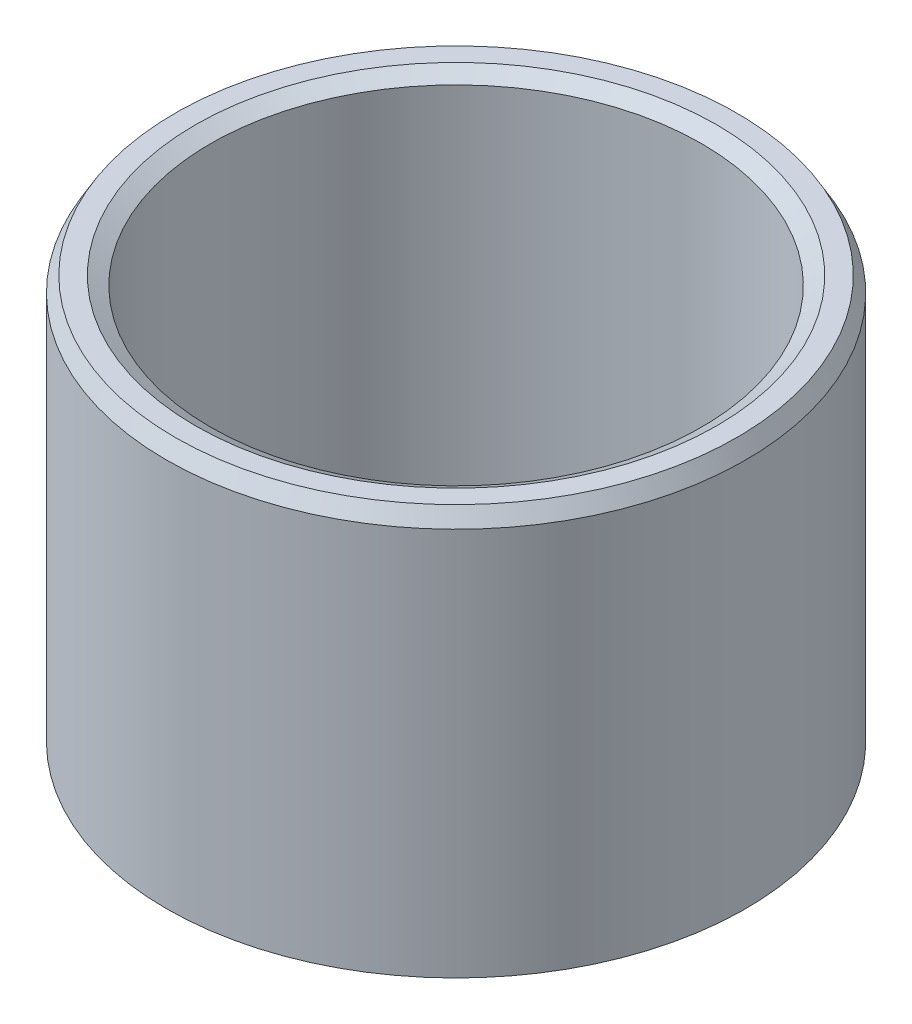
ISO-10303-21;
HEADER;
FILE_DESCRIPTION(('STEP AP214'),'2;1');
FILE_NAME('part.step','',(''),(''),'','','');
FILE_SCHEMA(('AUTOMOTIVE_DESIGN { 1 0 10303 214 1 1 1 1 }'));
ENDSEC;
DATA;
#1=APPLICATION_CONTEXT('core data for automotive mechanical design processes');
#2=APPLICATION_PROTOCOL_DEFINITION('international standard','automotive_design',2000,#1);
#3=PRODUCT_CONTEXT('',#1,'mechanical');
#4=PRODUCT('Part','Part','',(#3));
#5=PRODUCT_RELATED_PRODUCT_CATEGORY('part','',(#4));
#6=PRODUCT_DEFINITION_FORMATION('','',#4);
#7=PRODUCT_DEFINITION_CONTEXT('part definition',#1,'design');
#8=PRODUCT_DEFINITION('design','',#6,#7);
#9=PRODUCT_DEFINITION_SHAPE('','',#8);
#10=(LENGTH_UNIT() NAMED_UNIT(*) SI_UNIT(.MILLI.,.METRE.));
#11=(NAMED_UNIT(*) PLANE_ANGLE_UNIT() SI_UNIT($,.RADIAN.));
#12=(NAMED_UNIT(*) SI_UNIT($,.STERADIAN.) SOLID_ANGLE_UNIT());
#13=UNCERTAINTY_MEASURE_WITH_UNIT(LENGTH_MEASURE(1.E-05),#10,'distance_accuracy_value','');
#14=(GEOMETRIC_REPRESENTATION_CONTEXT(3) GLOBAL_UNCERTAINTY_ASSIGNED_CONTEXT((#13)) GLOBAL_UNIT_ASSIGNED_CONTEXT((#10,
#11,#12)) REPRESENTATION_CONTEXT('',''));
#15=CARTESIAN_POINT('',(0.,0.,0.));
#16=DIRECTION('',(0.,0.,1.));
#17=DIRECTION('',(1.,0.,0.));
#18=AXIS2_PLACEMENT_3D('',#15,#16,#17);
#19=CARTESIAN_POINT('',(0.,85.4439495294284,0.));
#20=DIRECTION('',(0.,-1.,0.));
#21=DIRECTION('',(0.,0.,-1.));
#22=AXIS2_PLACEMENT_3D('',#19,#20,#21);
#23=CYLINDRICAL_SURFACE('',#22,60.);
#24=CARTESIAN_POINT('',(0.,1.81136118549563,0.));
#25=DIRECTION('',(0.,1.,0.));
#26=DIRECTION('',(0.,0.,1.));
#27=AXIS2_PLACEMENT_3D('',#24,#25,#26);
#28=CIRCLE('',#27,60.);
#29=CARTESIAN_POINT('',(0.,1.81136118549563,60.));
#30=VERTEX_POINT('',#29);
#31=EDGE_CURVE('E10',#30,#30,#28,.T.);
#32=ORIENTED_EDGE('',*,*,#31,.T.);
#33=EDGE_LOOP('',(#32));
#34=FACE_BOUND('',#33,.T.);
#35=CARTESIAN_POINT('',(0.,82.3065799252917,0.));
#36=DIRECTION('',(0.,1.,0.));
#37=DIRECTION('',(0.,0.,1.));
#38=AXIS2_PLACEMENT_3D('',#35,#36,#37);
#39=CIRCLE('',#38,60.);
#40=CARTESIAN_POINT('',(0.,82.3065799252917,60.));
#41=VERTEX_POINT('',#40);
#42=EDGE_CURVE('E50',#41,#41,#39,.F.);
#43=ORIENTED_EDGE('',*,*,#42,.T.);
#44=EDGE_LOOP('',(#43));
#45=FACE_BOUND('',#44,.T.);
#46=ADVANCED_FACE('F39',(#34,#45),#23,.T.);
#47=CARTESIAN_POINT('',(0.,85.4439495294284,0.));
#48=DIRECTION('',(0.,1.,0.));
#49=DIRECTION('',(0.,0.,1.));
#50=AXIS2_PLACEMENT_3D('',#47,#48,#49);
#51=PLANE('',#50);
#52=CARTESIAN_POINT('',(0.,85.4439495294284,0.));
#53=DIRECTION('',(0.,1.,0.));
#54=DIRECTION('',(0.,0.,1.));
#55=AXIS2_PLACEMENT_3D('',#52,#53,#54);
#56=CIRCLE('',#55,54.0024252240746);
#57=CARTESIAN_POINT('',(0.,85.4439495294284,54.0024252240746));
#58=VERTEX_POINT('',#57);
#59=EDGE_CURVE('E58',#58,#58,#56,.F.);
#60=ORIENTED_EDGE('',*,*,#59,.T.);
#61=EDGE_LOOP('',(#60));
#62=FACE_BOUND('',#61,.T.);
#63=CARTESIAN_POINT('',(0.,85.4439495294284,0.));
#64=DIRECTION('',(0.,1.,0.));
#65=DIRECTION('',(0.,0.,1.));
#66=AXIS2_PLACEMENT_3D('',#63,#64,#65);
#67=CIRCLE('',#66,58.1886388145043);
#68=CARTESIAN_POINT('',(0.,85.4439495294284,58.1886388145043));
#69=VERTEX_POINT('',#68);
#70=EDGE_CURVE('E61',#69,#69,#67,.T.);
#71=ORIENTED_EDGE('',*,*,#70,.T.);
#72=EDGE_LOOP('',(#71));
#73=FACE_BOUND('',#72,.T.);
#74=ADVANCED_FACE('F88',(#62,#73),#51,.T.);
#75=CARTESIAN_POINT('',(0.,0.,0.));
#76=DIRECTION('',(0.,1.,0.));
#77=DIRECTION('',(0.,0.,1.));
#78=AXIS2_PLACEMENT_3D('',#75,#76,#77);
#79=PLANE('',#78);
#80=CARTESIAN_POINT('',(0.,0.,0.));
#81=DIRECTION('',(0.,1.,0.));
#82=DIRECTION('',(0.,0.,1.));
#83=AXIS2_PLACEMENT_3D('',#80,#81,#82);
#84=CIRCLE('',#83,52.6764168054336);
#85=CARTESIAN_POINT('',(0.,0.,52.6764168054336));
#86=VERTEX_POINT('',#85);
#87=EDGE_CURVE('E51',#86,#86,#84,.T.);
#88=ORIENTED_EDGE('',*,*,#87,.T.);
#89=EDGE_LOOP('',(#88));
#90=FACE_BOUND('',#89,.T.);
#91=CARTESIAN_POINT('',(0.,0.,0.));
#92=DIRECTION('',(0.,1.,0.));
#93=DIRECTION('',(0.,0.,1.));
#94=AXIS2_PLACEMENT_3D('',#91,#92,#93);
#95=CIRCLE('',#94,56.8626303958633);
#96=CARTESIAN_POINT('',(0.,0.,56.8626303958633));
#97=VERTEX_POINT('',#96);
#98=EDGE_CURVE('E54',#97,#97,#95,.F.);
#99=ORIENTED_EDGE('',*,*,#98,.T.);
#100=EDGE_LOOP('',(#99));
#101=FACE_BOUND('',#100,.T.);
#102=ADVANCED_FACE('F83',(#90,#101),#79,.F.);
#103=CARTESIAN_POINT('',(0.,85.4439495294284,0.));
#104=DIRECTION('',(0.,-1.,0.));
#105=DIRECTION('',(0.,0.,-1.));
#106=AXIS2_PLACEMENT_3D('',#103,#104,#105);
#107=CYLINDRICAL_SURFACE('',#106,50.865055619938);
#108=CARTESIAN_POINT('',(0.,83.6325883439328,0.));
#109=DIRECTION('',(0.,1.,0.));
#110=DIRECTION('',(0.,0.,1.));
#111=AXIS2_PLACEMENT_3D('',#108,#109,#110);
#112=CIRCLE('',#111,50.865055619938);
#113=CARTESIAN_POINT('',(0.,83.6325883439328,50.865055619938));
#114=VERTEX_POINT('',#113);
#115=EDGE_CURVE('E67',#114,#114,#112,.T.);
#116=ORIENTED_EDGE('',*,*,#115,.T.);
#117=EDGE_LOOP('',(#116));
#118=FACE_BOUND('',#117,.T.);
#119=CARTESIAN_POINT('',(0.,3.13736960413662,0.));
#120=DIRECTION('',(0.,1.,0.));
#121=DIRECTION('',(0.,0.,1.));
#122=AXIS2_PLACEMENT_3D('',#119,#120,#121);
#123=CIRCLE('',#122,50.865055619938);
#124=CARTESIAN_POINT('',(0.,3.13736960413662,50.865055619938));
#125=VERTEX_POINT('',#124);
#126=EDGE_CURVE('E69',#125,#125,#123,.F.);
#127=ORIENTED_EDGE('',*,*,#126,.T.);
#128=EDGE_LOOP('',(#127));
#129=FACE_BOUND('',#128,.T.);
#130=ADVANCED_FACE('F71',(#118,#129),#107,.F.);
#131=CARTESIAN_POINT('',(0.,83.6325883439328,0.));
#132=DIRECTION('',(0.,1.,0.));
#133=DIRECTION('',(0.,0.,1.));
#134=AXIS2_PLACEMENT_3D('',#131,#132,#133);
#135=CONICAL_SURFACE('',#134,50.865055619938,1.0471975511966);
#136=ORIENTED_EDGE('',*,*,#59,.F.);
#137=EDGE_LOOP('',(#136));
#138=FACE_BOUND('',#137,.T.);
#139=ORIENTED_EDGE('',*,*,#115,.F.);
#140=EDGE_LOOP('',(#139));
#141=FACE_BOUND('',#140,.T.);
#142=ADVANCED_FACE('F77',(#138,#141),#135,.F.);
#143=CARTESIAN_POINT('',(0.,0.,0.));
#144=DIRECTION('',(0.,-1.,0.));
#145=DIRECTION('',(0.,0.,-1.));
#146=AXIS2_PLACEMENT_3D('',#143,#144,#145);
#147=CONICAL_SURFACE('',#146,52.6764168054336,0.523598775598295);
#148=ORIENTED_EDGE('',*,*,#126,.F.);
#149=EDGE_LOOP('',(#148));
#150=FACE_BOUND('',#149,.T.);
#151=ORIENTED_EDGE('',*,*,#87,.F.);
#152=EDGE_LOOP('',(#151));
#153=FACE_BOUND('',#152,.T.);
#154=ADVANCED_FACE('F73',(#150,#153),#147,.F.);
#155=CARTESIAN_POINT('',(0.,1.81136118549563,0.));
#156=DIRECTION('',(0.,1.,0.));
#157=DIRECTION('',(0.,0.,1.));
#158=AXIS2_PLACEMENT_3D('',#155,#156,#157);
#159=CONICAL_SURFACE('',#158,60.,1.0471975511966);
#160=CARTESIAN_POINT('',(0.,0.,56.8626303958633));
#161=CARTESIAN_POINT('',(0.,0.0188683456822476,56.8953113292398));
#162=CARTESIAN_POINT('',(0.,0.0377366913644931,56.9279922626162));
#163=CARTESIAN_POINT('',(0.,0.0754733827289843,56.993354129369));
#164=CARTESIAN_POINT('',(0.,0.0943417284112299,57.0260350627454));
#165=CARTESIAN_POINT('',(0.,0.132078419775722,57.0913969294983));
#166=CARTESIAN_POINT('',(0.,0.150946765457969,57.1240778628747));
#167=CARTESIAN_POINT('',(0.,0.188683456822462,57.1894397296276));
#168=CARTESIAN_POINT('',(0.,0.207551802504707,57.222120663004));
#169=CARTESIAN_POINT('',(0.,0.245288493869199,57.2874825297568));
#170=CARTESIAN_POINT('',(0.,0.264156839551445,57.3201634631333));
#171=CARTESIAN_POINT('',(0.,0.301893530915939,57.3855253298861));
#172=CARTESIAN_POINT('',(0.,0.320761876598185,57.4182062632625));
#173=CARTESIAN_POINT('',(0.,0.358498567962677,57.4835681300154));
#174=CARTESIAN_POINT('',(0.,0.377366913644922,57.5162490633918));
#175=CARTESIAN_POINT('',(0.,0.415103605009415,57.5816109301447));
#176=CARTESIAN_POINT('',(0.,0.433971950691662,57.6142918635211));
#177=CARTESIAN_POINT('',(0.,0.471708642056154,57.6796537302739));
#178=CARTESIAN_POINT('',(0.,0.490576987738399,57.7123346636503));
#179=CARTESIAN_POINT('',(0.,0.528313679102891,57.7776965304032));
#180=CARTESIAN_POINT('',(0.,0.547182024785138,57.8103774637796));
#181=CARTESIAN_POINT('',(0.,0.584918716149631,57.8757393305325));
#182=CARTESIAN_POINT('',(0.,0.603787061831877,57.9084202639089));
#183=CARTESIAN_POINT('',(0.,0.641523753196369,57.9737821306617));
#184=CARTESIAN_POINT('',(0.,0.660392098878614,58.0064630640382));
#185=CARTESIAN_POINT('',(0.,0.698128790243107,58.071824930791));
#186=CARTESIAN_POINT('',(0.,0.716997135925354,58.1045058641674));
#187=CARTESIAN_POINT('',(0.,0.754733827289846,58.1698677309203));
#188=CARTESIAN_POINT('',(0.,0.773602172972092,58.2025486642967));
#189=CARTESIAN_POINT('',(0.,0.811338864336583,58.2679105310496));
#190=CARTESIAN_POINT('',(0.,0.83020721001883,58.300591464426));
#191=CARTESIAN_POINT('',(0.,0.867943901383323,58.3659533311788));
#192=CARTESIAN_POINT('',(0.,0.886812247065569,58.3986342645552));
#193=CARTESIAN_POINT('',(0.,0.924548938430061,58.4639961313081));
#194=CARTESIAN_POINT('',(0.,0.943417284112307,58.4966770646845));
#195=CARTESIAN_POINT('',(0.,0.981153975476799,58.5620389314374));
#196=CARTESIAN_POINT('',(0.,1.00002232115905,58.5947198648138));
#197=CARTESIAN_POINT('',(0.,1.03775901252354,58.6600817315666));
#198=CARTESIAN_POINT('',(0.,1.05662735820578,58.6927626649431));
#199=CARTESIAN_POINT('',(0.,1.09436404957028,58.7581245316959));
#200=CARTESIAN_POINT('',(0.,1.11323239525252,58.7908054650723));
#201=CARTESIAN_POINT('',(0.,1.15096908661702,58.8561673318252));
#202=CARTESIAN_POINT('',(0.,1.16983743229926,58.8888482652016));
#203=CARTESIAN_POINT('',(0.,1.20757412366375,58.9542101319544));
#204=CARTESIAN_POINT('',(0.,1.226442469346,58.9868910653309));
#205=CARTESIAN_POINT('',(0.,1.26417916071049,59.0522529320837));
#206=CARTESIAN_POINT('',(0.,1.28304750639274,59.0849338654601));
#207=CARTESIAN_POINT('',(0.,1.32078419775723,59.150295732213));
#208=CARTESIAN_POINT('',(0.,1.33965254343948,59.1829766655894));
#209=CARTESIAN_POINT('',(0.,1.37738923480397,59.2483385323423));
#210=CARTESIAN_POINT('',(0.,1.39625758048622,59.2810194657187));
#211=CARTESIAN_POINT('',(0.,1.43399427185071,59.3463813324715));
#212=CARTESIAN_POINT('',(0.,1.45286261753295,59.3790622658479));
#213=CARTESIAN_POINT('',(0.,1.49059930889744,59.4444241326008));
#214=CARTESIAN_POINT('',(0.,1.50946765457969,59.4771050659772));
#215=CARTESIAN_POINT('',(0.,1.54720434594418,59.5424669327301));
#216=CARTESIAN_POINT('',(0.,1.56607269162643,59.5751478661065));
#217=CARTESIAN_POINT('',(0.,1.60380938299092,59.6405097328593));
#218=CARTESIAN_POINT('',(0.,1.62267772867317,59.6731906662358));
#219=CARTESIAN_POINT('',(0.,1.66041442003766,59.7385525329886));
#220=CARTESIAN_POINT('',(0.,1.67928276571991,59.771233466365));
#221=CARTESIAN_POINT('',(0.,1.7170194570844,59.8365953331179));
#222=CARTESIAN_POINT('',(0.,1.73588780276665,59.8692762664943));
#223=CARTESIAN_POINT('',(0.,1.77362449413114,59.9346381332472));
#224=CARTESIAN_POINT('',(0.,1.79249283981338,59.9673190666236));
#225=CARTESIAN_POINT('',(0.,1.81136118549563,60.));
#226=B_SPLINE_CURVE_WITH_KNOTS('',3,(#160,#161,#162,#163,#164,#165,#166,#167,#168,#169,#170,
#171,#172,#173,#174,#175,#176,#177,#178,#179,#180,#181,#182,#183,#184,#185,#186,#187,#188,#189,
#190,#191,#192,#193,#194,#195,#196,#197,#198,#199,#200,#201,#202,#203,#204,#205,#206,#207,#208,
#209,#210,#211,#212,#213,#214,#215,#216,#217,#218,#219,#220,#221,#222,#223,#224,#225),
.UNSPECIFIED.,.F.,.F.,(4,2,2,2,2,2,2,2,2,2,2,2,2,2,2,2,2,2,2,2,2,2,2,2,2,2,2,2,2,2,2,2,4),(0.,
0.113210074093476,0.226420148186957,0.339630222280433,0.452840296373914,0.56605037046739,
0.679260444560865,0.792470518654347,0.905680592747822,1.0188906668413,1.13210074093478,
1.24531081502825,1.35852088912174,1.47173096321521,1.58494103730869,1.69815111140217,
1.81136118549564,1.92457125958913,2.0377813336826,2.15099140777608,2.26420148186956,
2.37741155596304,2.49062163005652,2.60383170414999,2.71704177824347,2.83025185233695,
2.94346192643043,3.05667200052391,3.16988207461738,3.28309214871086,3.39630222280434,
3.50951229689782,3.6227223709913),.UNSPECIFIED.);
#227=EDGE_CURVE('BSEAM76',#97,#30,#226,.T.);
#228=ORIENTED_EDGE('',*,*,#98,.F.);
#229=ORIENTED_EDGE('',*,*,#31,.F.);
#230=ORIENTED_EDGE('',*,*,#227,.T.);
#231=ORIENTED_EDGE('',*,*,#227,.F.);
#232=EDGE_LOOP('',(#228,#230,#229,#231));
#233=FACE_BOUND('',#232,.T.);
#234=ADVANCED_FACE('F76',(#233),#159,.T.);
#235=CARTESIAN_POINT('',(0.,85.4439495294284,0.));
#236=DIRECTION('',(0.,-1.,0.));
#237=DIRECTION('',(0.,0.,-1.));
#238=AXIS2_PLACEMENT_3D('',#235,#236,#237);
#239=CONICAL_SURFACE('',#238,58.1886388145043,0.5235987755983);
#240=ORIENTED_EDGE('',*,*,#42,.F.);
#241=EDGE_LOOP('',(#240));
#242=FACE_BOUND('',#241,.T.);
#243=ORIENTED_EDGE('',*,*,#70,.F.);
#244=EDGE_LOOP('',(#243));
#245=FACE_BOUND('',#244,.T.);
#246=ADVANCED_FACE('F45',(#242,#245),#239,.T.);
#247=CLOSED_SHELL('',(#46,#74,#102,#130,#142,#154,#234,#246));
#248=MANIFOLD_SOLID_BREP('B2',#247);
#249=ADVANCED_BREP_SHAPE_REPRESENTATION('',(#18,#248),#14);
#250=SHAPE_DEFINITION_REPRESENTATION(#9,#249);
ENDSEC;
END-ISO-10303-21;
